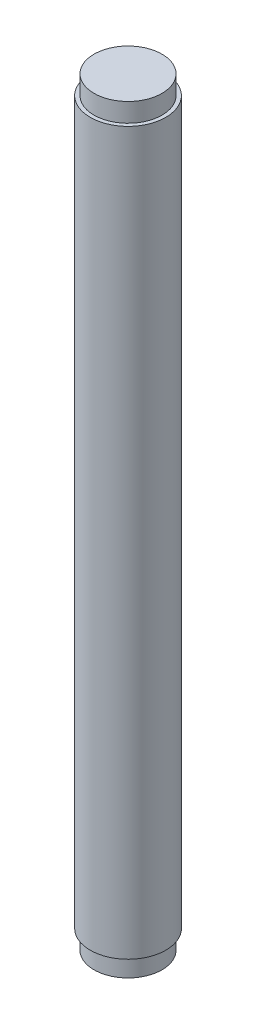
ISO-10303-21;
HEADER;
FILE_DESCRIPTION(('STEP AP214'),'2;1');
FILE_NAME('part.step','',(''),(''),'','','');
FILE_SCHEMA(('AUTOMOTIVE_DESIGN { 1 0 10303 214 1 1 1 1 }'));
ENDSEC;
DATA;
#1=APPLICATION_CONTEXT('core data for automotive mechanical design processes');
#2=APPLICATION_PROTOCOL_DEFINITION('international standard','automotive_design',2000,#1);
#3=PRODUCT_CONTEXT('',#1,'mechanical');
#4=PRODUCT('Part','Part','',(#3));
#5=PRODUCT_RELATED_PRODUCT_CATEGORY('part','',(#4));
#6=PRODUCT_DEFINITION_FORMATION('','',#4);
#7=PRODUCT_DEFINITION_CONTEXT('part definition',#1,'design');
#8=PRODUCT_DEFINITION('design','',#6,#7);
#9=PRODUCT_DEFINITION_SHAPE('','',#8);
#10=(LENGTH_UNIT() NAMED_UNIT(*) SI_UNIT(.MILLI.,.METRE.));
#11=(NAMED_UNIT(*) PLANE_ANGLE_UNIT() SI_UNIT($,.RADIAN.));
#12=(NAMED_UNIT(*) SI_UNIT($,.STERADIAN.) SOLID_ANGLE_UNIT());
#13=UNCERTAINTY_MEASURE_WITH_UNIT(LENGTH_MEASURE(1.E-05),#10,'distance_accuracy_value','');
#14=(GEOMETRIC_REPRESENTATION_CONTEXT(3) GLOBAL_UNCERTAINTY_ASSIGNED_CONTEXT((#13)) GLOBAL_UNIT_ASSIGNED_CONTEXT((#10,
#11,#12)) REPRESENTATION_CONTEXT('',''));
#15=CARTESIAN_POINT('',(0.,0.,0.));
#16=DIRECTION('',(0.,0.,1.));
#17=DIRECTION('',(1.,0.,0.));
#18=AXIS2_PLACEMENT_3D('',#15,#16,#17);
#19=CARTESIAN_POINT('',(0.,100.5,0.));
#20=DIRECTION('',(0.,-1.,0.));
#21=DIRECTION('',(0.,0.,-1.));
#22=AXIS2_PLACEMENT_3D('',#19,#20,#21);
#23=CYLINDRICAL_SURFACE('',#22,5.);
#24=CARTESIAN_POINT('',(0.,2.5,0.));
#25=DIRECTION('',(0.,-1.,0.));
#26=DIRECTION('',(0.,0.,-1.));
#27=AXIS2_PLACEMENT_3D('',#24,#25,#26);
#28=CIRCLE('',#27,5.);
#29=CARTESIAN_POINT('',(0.,2.5,-5.));
#30=VERTEX_POINT('',#29);
#31=EDGE_CURVE('E10',#30,#30,#28,.T.);
#32=ORIENTED_EDGE('',*,*,#31,.F.);
#33=EDGE_LOOP('',(#32));
#34=FACE_BOUND('',#33,.T.);
#35=CARTESIAN_POINT('',(0.,98.,0.));
#36=DIRECTION('',(0.,1.,0.));
#37=DIRECTION('',(0.,0.,1.));
#38=AXIS2_PLACEMENT_3D('',#35,#36,#37);
#39=CIRCLE('',#38,5.);
#40=CARTESIAN_POINT('',(0.,98.,5.));
#41=VERTEX_POINT('',#40);
#42=EDGE_CURVE('E46',#41,#41,#39,.T.);
#43=ORIENTED_EDGE('',*,*,#42,.F.);
#44=EDGE_LOOP('',(#43));
#45=FACE_BOUND('',#44,.T.);
#46=ADVANCED_FACE('F31',(#34,#45),#23,.T.);
#47=CARTESIAN_POINT('',(0.,2.5,0.));
#48=DIRECTION('',(0.,-1.,0.));
#49=DIRECTION('',(0.,0.,-1.));
#50=AXIS2_PLACEMENT_3D('',#47,#48,#49);
#51=PLANE('',#50);
#52=CARTESIAN_POINT('',(0.,2.5,0.));
#53=DIRECTION('',(0.,-1.,0.));
#54=DIRECTION('',(0.,0.,-1.));
#55=AXIS2_PLACEMENT_3D('',#52,#53,#54);
#56=CIRCLE('',#55,4.5);
#57=CARTESIAN_POINT('',(0.,2.5,-4.5));
#58=VERTEX_POINT('',#57);
#59=EDGE_CURVE('E37',#58,#58,#56,.T.);
#60=ORIENTED_EDGE('',*,*,#59,.F.);
#61=EDGE_LOOP('',(#60));
#62=FACE_BOUND('',#61,.T.);
#63=ORIENTED_EDGE('',*,*,#31,.T.);
#64=EDGE_LOOP('',(#63));
#65=FACE_BOUND('',#64,.T.);
#66=ADVANCED_FACE('F68',(#62,#65),#51,.T.);
#67=CARTESIAN_POINT('',(0.,2.5,0.));
#68=DIRECTION('',(0.,-1.,0.));
#69=DIRECTION('',(0.,0.,-1.));
#70=AXIS2_PLACEMENT_3D('',#67,#68,#69);
#71=CYLINDRICAL_SURFACE('',#70,4.5);
#72=ORIENTED_EDGE('',*,*,#59,.T.);
#73=EDGE_LOOP('',(#72));
#74=FACE_BOUND('',#73,.T.);
#75=CARTESIAN_POINT('',(0.,0.,0.));
#76=DIRECTION('',(0.,-1.,0.));
#77=DIRECTION('',(0.,0.,-1.));
#78=AXIS2_PLACEMENT_3D('',#75,#76,#77);
#79=CIRCLE('',#78,4.5);
#80=CARTESIAN_POINT('',(0.,0.,-4.5));
#81=VERTEX_POINT('',#80);
#82=EDGE_CURVE('E41',#81,#81,#79,.T.);
#83=ORIENTED_EDGE('',*,*,#82,.F.);
#84=EDGE_LOOP('',(#83));
#85=FACE_BOUND('',#84,.T.);
#86=ADVANCED_FACE('F73',(#74,#85),#71,.T.);
#87=CARTESIAN_POINT('',(0.,0.,0.));
#88=DIRECTION('',(0.,1.,0.));
#89=DIRECTION('',(0.,0.,1.));
#90=AXIS2_PLACEMENT_3D('',#87,#88,#89);
#91=PLANE('',#90);
#92=ORIENTED_EDGE('',*,*,#82,.T.);
#93=EDGE_LOOP('',(#92));
#94=FACE_BOUND('',#93,.T.);
#95=ADVANCED_FACE('F63',(#94),#91,.F.);
#96=CARTESIAN_POINT('',(0.,98.,0.));
#97=DIRECTION('',(0.,1.,0.));
#98=DIRECTION('',(0.,0.,1.));
#99=AXIS2_PLACEMENT_3D('',#96,#97,#98);
#100=PLANE('',#99);
#101=CARTESIAN_POINT('',(0.,98.,0.));
#102=DIRECTION('',(0.,1.,0.));
#103=DIRECTION('',(0.,0.,1.));
#104=AXIS2_PLACEMENT_3D('',#101,#102,#103);
#105=CIRCLE('',#104,4.5);
#106=CARTESIAN_POINT('',(0.,98.,4.5));
#107=VERTEX_POINT('',#106);
#108=EDGE_CURVE('E50',#107,#107,#105,.T.);
#109=ORIENTED_EDGE('',*,*,#108,.F.);
#110=EDGE_LOOP('',(#109));
#111=FACE_BOUND('',#110,.T.);
#112=ORIENTED_EDGE('',*,*,#42,.T.);
#113=EDGE_LOOP('',(#112));
#114=FACE_BOUND('',#113,.T.);
#115=ADVANCED_FACE('F60',(#111,#114),#100,.T.);
#116=CARTESIAN_POINT('',(0.,98.,0.));
#117=DIRECTION('',(0.,1.,0.));
#118=DIRECTION('',(0.,0.,1.));
#119=AXIS2_PLACEMENT_3D('',#116,#117,#118);
#120=CYLINDRICAL_SURFACE('',#119,4.5);
#121=ORIENTED_EDGE('',*,*,#108,.T.);
#122=EDGE_LOOP('',(#121));
#123=FACE_BOUND('',#122,.T.);
#124=CARTESIAN_POINT('',(0.,100.5,0.));
#125=DIRECTION('',(0.,1.,0.));
#126=DIRECTION('',(0.,0.,1.));
#127=AXIS2_PLACEMENT_3D('',#124,#125,#126);
#128=CIRCLE('',#127,4.5);
#129=CARTESIAN_POINT('',(0.,100.5,4.5));
#130=VERTEX_POINT('',#129);
#131=EDGE_CURVE('E51',#130,#130,#128,.T.);
#132=ORIENTED_EDGE('',*,*,#131,.F.);
#133=EDGE_LOOP('',(#132));
#134=FACE_BOUND('',#133,.T.);
#135=ADVANCED_FACE('F57',(#123,#134),#120,.T.);
#136=CARTESIAN_POINT('',(0.,100.5,0.));
#137=DIRECTION('',(0.,1.,0.));
#138=DIRECTION('',(0.,0.,1.));
#139=AXIS2_PLACEMENT_3D('',#136,#137,#138);
#140=PLANE('',#139);
#141=ORIENTED_EDGE('',*,*,#131,.T.);
#142=EDGE_LOOP('',(#141));
#143=FACE_BOUND('',#142,.T.);
#144=ADVANCED_FACE('F81',(#143),#140,.T.);
#145=CLOSED_SHELL('',(#46,#66,#86,#95,#115,#135,#144));
#146=MANIFOLD_SOLID_BREP('B2',#145);
#147=ADVANCED_BREP_SHAPE_REPRESENTATION('',(#18,#146),#14);
#148=SHAPE_DEFINITION_REPRESENTATION(#9,#147);
ENDSEC;
END-ISO-10303-21;
